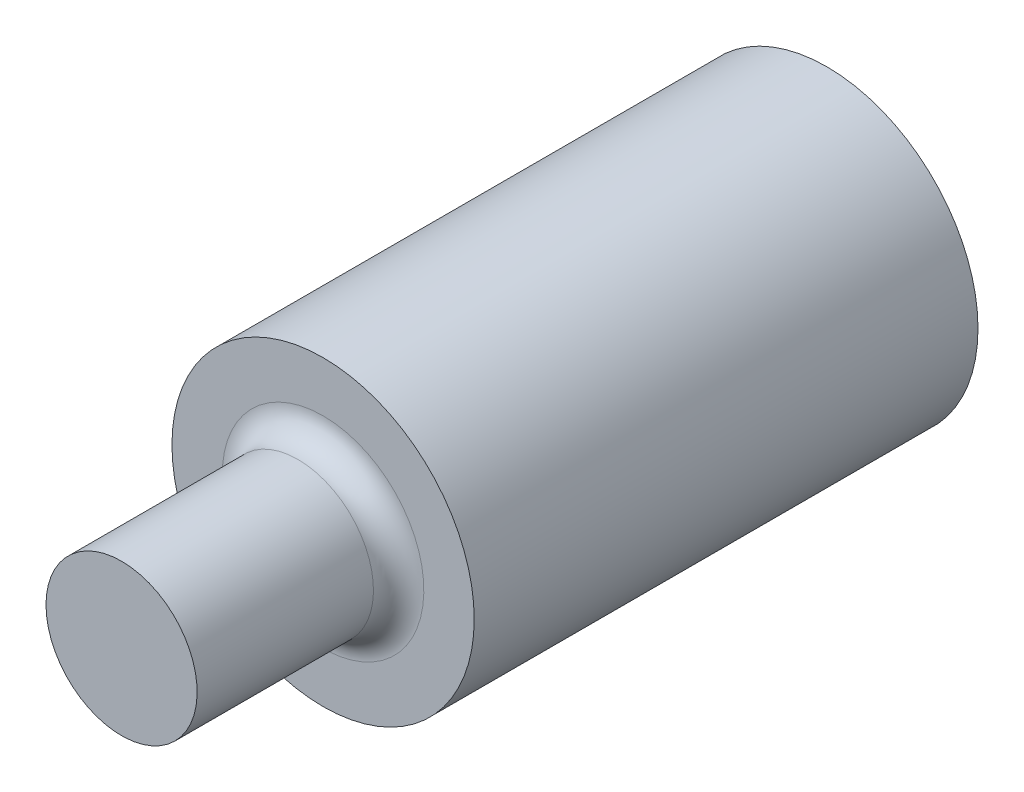
ISO-10303-21;
HEADER;
FILE_DESCRIPTION(('STEP AP214'),'2;1');
FILE_NAME('part.step','',(''),(''),'','','');
FILE_SCHEMA(('AUTOMOTIVE_DESIGN { 1 0 10303 214 1 1 1 1 }'));
ENDSEC;
DATA;
#1=APPLICATION_CONTEXT('core data for automotive mechanical design processes');
#2=APPLICATION_PROTOCOL_DEFINITION('international standard','automotive_design',2000,#1);
#3=PRODUCT_CONTEXT('',#1,'mechanical');
#4=PRODUCT('Part','Part','',(#3));
#5=PRODUCT_RELATED_PRODUCT_CATEGORY('part','',(#4));
#6=PRODUCT_DEFINITION_FORMATION('','',#4);
#7=PRODUCT_DEFINITION_CONTEXT('part definition',#1,'design');
#8=PRODUCT_DEFINITION('design','',#6,#7);
#9=PRODUCT_DEFINITION_SHAPE('','',#8);
#10=(LENGTH_UNIT() NAMED_UNIT(*) SI_UNIT(.MILLI.,.METRE.));
#11=(NAMED_UNIT(*) PLANE_ANGLE_UNIT() SI_UNIT($,.RADIAN.));
#12=(NAMED_UNIT(*) SI_UNIT($,.STERADIAN.) SOLID_ANGLE_UNIT());
#13=UNCERTAINTY_MEASURE_WITH_UNIT(LENGTH_MEASURE(1.E-05),#10,'distance_accuracy_value','');
#14=(GEOMETRIC_REPRESENTATION_CONTEXT(3) GLOBAL_UNCERTAINTY_ASSIGNED_CONTEXT((#13)) GLOBAL_UNIT_ASSIGNED_CONTEXT((#10,
#11,#12)) REPRESENTATION_CONTEXT('',''));
#15=CARTESIAN_POINT('',(0.,0.,0.));
#16=DIRECTION('',(0.,0.,1.));
#17=DIRECTION('',(1.,0.,0.));
#18=AXIS2_PLACEMENT_3D('',#15,#16,#17);
#19=CARTESIAN_POINT('',(0.,1.5,-34.));
#20=DIRECTION('',(0.,0.,-1.));
#21=DIRECTION('',(0.,1.,0.));
#22=AXIS2_PLACEMENT_3D('',#19,#20,#21);
#23=PLANE('',#22);
#24=CARTESIAN_POINT('',(0.,0.,-34.));
#25=DIRECTION('',(0.,0.,-1.));
#26=DIRECTION('',(0.,1.,0.));
#27=AXIS2_PLACEMENT_3D('',#24,#25,#26);
#28=CIRCLE('',#27,1.50000000000001);
#29=CARTESIAN_POINT('',(0.,1.5,-34.));
#30=VERTEX_POINT('',#29);
#31=EDGE_CURVE('E10',#30,#30,#28,.T.);
#32=ORIENTED_EDGE('',*,*,#31,.T.);
#33=EDGE_LOOP('',(#32));
#34=FACE_BOUND('',#33,.T.);
#35=ADVANCED_FACE('F32',(#34),#23,.T.);
#36=CARTESIAN_POINT('',(0.,0.,-34.));
#37=DIRECTION('',(0.,0.,-1.));
#38=DIRECTION('',(0.,1.,0.));
#39=AXIS2_PLACEMENT_3D('',#36,#37,#38);
#40=CYLINDRICAL_SURFACE('',#39,1.50000000000001);
#41=CARTESIAN_POINT('',(0.,0.,-29.));
#42=DIRECTION('',(0.,0.,-1.));
#43=DIRECTION('',(0.,1.,0.));
#44=AXIS2_PLACEMENT_3D('',#41,#42,#43);
#45=CIRCLE('',#44,1.50000000000001);
#46=CARTESIAN_POINT('',(0.,1.5,-29.));
#47=VERTEX_POINT('',#46);
#48=EDGE_CURVE('E39',#47,#47,#45,.T.);
#49=ORIENTED_EDGE('',*,*,#48,.T.);
#50=EDGE_LOOP('',(#49));
#51=FACE_BOUND('',#50,.T.);
#52=ORIENTED_EDGE('',*,*,#31,.F.);
#53=EDGE_LOOP('',(#52));
#54=FACE_BOUND('',#53,.T.);
#55=ADVANCED_FACE('F70',(#51,#54),#40,.T.);
#56=CARTESIAN_POINT('',(0.,0.999999999999993,-29.));
#57=DIRECTION('',(0.,0.,1.));
#58=DIRECTION('',(0.,-1.,0.));
#59=AXIS2_PLACEMENT_3D('',#56,#57,#58);
#60=PLANE('',#59);
#61=CARTESIAN_POINT('',(0.,0.,-29.));
#62=DIRECTION('',(0.,0.,-1.));
#63=DIRECTION('',(0.,1.,0.));
#64=AXIS2_PLACEMENT_3D('',#61,#62,#63);
#65=CIRCLE('',#64,0.999999999999999);
#66=CARTESIAN_POINT('',(0.,0.999999999999993,-29.));
#67=VERTEX_POINT('',#66);
#68=EDGE_CURVE('E43',#67,#67,#65,.T.);
#69=ORIENTED_EDGE('',*,*,#68,.T.);
#70=EDGE_LOOP('',(#69));
#71=FACE_BOUND('',#70,.T.);
#72=ORIENTED_EDGE('',*,*,#48,.F.);
#73=EDGE_LOOP('',(#72));
#74=FACE_BOUND('',#73,.T.);
#75=ADVANCED_FACE('F67',(#71,#74),#60,.T.);
#76=CARTESIAN_POINT('',(0.,0.,-28.75));
#77=DIRECTION('',(0.,0.,-1.));
#78=DIRECTION('',(0.,1.,0.));
#79=AXIS2_PLACEMENT_3D('',#76,#77,#78);
#80=TOROIDAL_SURFACE('',#79,0.999999999999999,0.25);
#81=CARTESIAN_POINT('',(0.,0.,-28.75));
#82=DIRECTION('',(0.,0.,-1.));
#83=DIRECTION('',(0.,1.,0.));
#84=AXIS2_PLACEMENT_3D('',#81,#82,#83);
#85=CIRCLE('',#84,0.749999999999999);
#86=CARTESIAN_POINT('',(0.,0.749999999999993,-28.75));
#87=VERTEX_POINT('',#86);
#88=EDGE_CURVE('E48',#87,#87,#85,.T.);
#89=ORIENTED_EDGE('',*,*,#88,.T.);
#90=EDGE_LOOP('',(#89));
#91=FACE_BOUND('',#90,.T.);
#92=ORIENTED_EDGE('',*,*,#68,.F.);
#93=EDGE_LOOP('',(#92));
#94=FACE_BOUND('',#93,.T.);
#95=ADVANCED_FACE('F60',(#91,#94),#80,.F.);
#96=CARTESIAN_POINT('',(0.,0.,-34.));
#97=DIRECTION('',(0.,0.,-1.));
#98=DIRECTION('',(0.,1.,0.));
#99=AXIS2_PLACEMENT_3D('',#96,#97,#98);
#100=CYLINDRICAL_SURFACE('',#99,0.749999999999996);
#101=CARTESIAN_POINT('',(0.,0.,-27.));
#102=DIRECTION('',(0.,0.,-1.));
#103=DIRECTION('',(-1.,0.,0.));
#104=AXIS2_PLACEMENT_3D('',#101,#102,#103);
#105=CIRCLE('',#104,0.749999999999996);
#106=CARTESIAN_POINT('',(-0.749999999999996,0.,-27.));
#107=VERTEX_POINT('',#106);
#108=EDGE_CURVE('E35',#107,#107,#105,.F.);
#109=ORIENTED_EDGE('',*,*,#108,.F.);
#110=EDGE_LOOP('',(#109));
#111=FACE_BOUND('',#110,.T.);
#112=ORIENTED_EDGE('',*,*,#88,.F.);
#113=EDGE_LOOP('',(#112));
#114=FACE_BOUND('',#113,.T.);
#115=ADVANCED_FACE('F57',(#111,#114),#100,.T.);
#116=CARTESIAN_POINT('',(-1.50000000000001,1.69133192389005,-27.));
#117=DIRECTION('',(0.,0.,-1.));
#118=DIRECTION('',(-1.,0.,0.));
#119=AXIS2_PLACEMENT_3D('',#116,#117,#118);
#120=PLANE('',#119);
#121=ORIENTED_EDGE('',*,*,#108,.T.);
#122=EDGE_LOOP('',(#121));
#123=FACE_BOUND('',#122,.T.);
#124=ADVANCED_FACE('F55',(#123),#120,.F.);
#125=CLOSED_SHELL('',(#35,#55,#75,#95,#115,#124));
#126=MANIFOLD_SOLID_BREP('B2',#125);
#127=ADVANCED_BREP_SHAPE_REPRESENTATION('',(#18,#126),#14);
#128=SHAPE_DEFINITION_REPRESENTATION(#9,#127);
ENDSEC;
END-ISO-10303-21;
